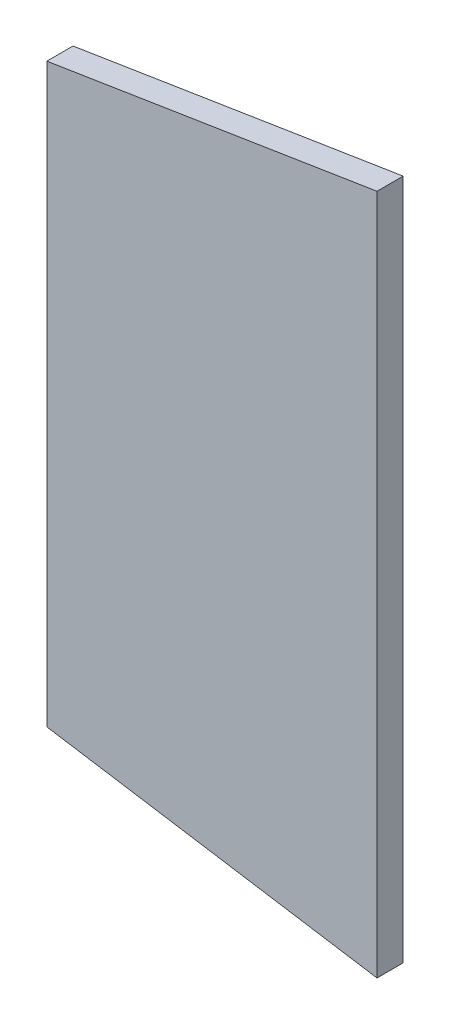
ISO-10303-21;
HEADER;
FILE_DESCRIPTION(('STEP AP214'),'2;1');
FILE_NAME('part.step','',(''),(''),'','','');
FILE_SCHEMA(('AUTOMOTIVE_DESIGN { 1 0 10303 214 1 1 1 1 }'));
ENDSEC;
DATA;
#1=APPLICATION_CONTEXT('core data for automotive mechanical design processes');
#2=APPLICATION_PROTOCOL_DEFINITION('international standard','automotive_design',2000,#1);
#3=PRODUCT_CONTEXT('',#1,'mechanical');
#4=PRODUCT('Part','Part','',(#3));
#5=PRODUCT_RELATED_PRODUCT_CATEGORY('part','',(#4));
#6=PRODUCT_DEFINITION_FORMATION('','',#4);
#7=PRODUCT_DEFINITION_CONTEXT('part definition',#1,'design');
#8=PRODUCT_DEFINITION('design','',#6,#7);
#9=PRODUCT_DEFINITION_SHAPE('','',#8);
#10=(LENGTH_UNIT() NAMED_UNIT(*) SI_UNIT(.MILLI.,.METRE.));
#11=(NAMED_UNIT(*) PLANE_ANGLE_UNIT() SI_UNIT($,.RADIAN.));
#12=(NAMED_UNIT(*) SI_UNIT($,.STERADIAN.) SOLID_ANGLE_UNIT());
#13=UNCERTAINTY_MEASURE_WITH_UNIT(LENGTH_MEASURE(1.E-05),#10,'distance_accuracy_value','');
#14=(GEOMETRIC_REPRESENTATION_CONTEXT(3) GLOBAL_UNCERTAINTY_ASSIGNED_CONTEXT((#13)) GLOBAL_UNIT_ASSIGNED_CONTEXT((#10,
#11,#12)) REPRESENTATION_CONTEXT('',''));
#15=CARTESIAN_POINT('',(0.,0.,0.));
#16=DIRECTION('',(0.,0.,1.));
#17=DIRECTION('',(1.,0.,0.));
#18=AXIS2_PLACEMENT_3D('',#15,#16,#17);
#19=CARTESIAN_POINT('',(-0.31500064,0.55000144,0.0499999));
#20=DIRECTION('',(0.,0.,1.));
#21=DIRECTION('',(1.,0.,0.));
#22=AXIS2_PLACEMENT_3D('',#19,#20,#21);
#23=PLANE('',#22);
#24=DIRECTION('',(0.,1.,0.));
#25=VECTOR('',#24,1.);
#26=CARTESIAN_POINT('',(0.31500064,0.65000124,0.0499999));
#27=LINE('',#26,#25);
#28=CARTESIAN_POINT('',(0.315000640000003,0.650001239999983,0.0499999));
#29=VERTEX_POINT('',#28);
#30=CARTESIAN_POINT('',(0.31500064,-0.6499987,0.0499999));
#31=VERTEX_POINT('',#30);
#32=EDGE_CURVE('E52',#29,#31,#27,.F.);
#33=ORIENTED_EDGE('',*,*,#32,.F.);
#34=DIRECTION('',(-0.987635626323415,-0.156766927688066,0.));
#35=VECTOR('',#34,1.);
#36=CARTESIAN_POINT('',(-0.31500064,0.55000144,0.0499999));
#37=LINE('',#36,#35);
#38=CARTESIAN_POINT('',(-0.31500064,0.55000144,0.0499999));
#39=VERTEX_POINT('',#38);
#40=EDGE_CURVE('E67',#39,#29,#37,.F.);
#41=ORIENTED_EDGE('',*,*,#40,.F.);
#42=DIRECTION('',(0.,1.,0.));
#43=VECTOR('',#42,1.);
#44=CARTESIAN_POINT('',(-0.31500064,-0.5499989,0.0499999));
#45=LINE('',#44,#43);
#46=CARTESIAN_POINT('',(-0.315000640000003,-0.549998900000017,0.0499999));
#47=VERTEX_POINT('',#46);
#48=EDGE_CURVE('E19',#47,#39,#45,.T.);
#49=ORIENTED_EDGE('',*,*,#48,.F.);
#50=DIRECTION('',(0.987635626323415,-0.156766927688066,0.));
#51=VECTOR('',#50,1.);
#52=CARTESIAN_POINT('',(0.31500064,-0.6499987,0.0499999));
#53=LINE('',#52,#51);
#54=EDGE_CURVE('E57',#31,#47,#53,.F.);
#55=ORIENTED_EDGE('',*,*,#54,.F.);
#56=EDGE_LOOP('',(#33,#41,#49,#55));
#57=FACE_BOUND('',#56,.T.);
#58=ADVANCED_FACE('F16',(#57),#23,.T.);
#59=CARTESIAN_POINT('',(-0.31500064,-0.5499989,0.));
#60=DIRECTION('',(-1.,0.,0.));
#61=DIRECTION('',(0.,0.,1.));
#62=AXIS2_PLACEMENT_3D('',#59,#60,#61);
#63=PLANE('',#62);
#64=DIRECTION('',(0.,0.,1.));
#65=VECTOR('',#64,1.);
#66=CARTESIAN_POINT('',(-0.31500064,0.55000144,0.));
#67=LINE('',#66,#65);
#68=CARTESIAN_POINT('',(-0.31500064,0.55000144,0.));
#69=VERTEX_POINT('',#68);
#70=EDGE_CURVE('E78',#69,#39,#67,.T.);
#71=ORIENTED_EDGE('',*,*,#70,.F.);
#72=DIRECTION('',(0.,1.,0.));
#73=VECTOR('',#72,1.);
#74=CARTESIAN_POINT('',(-0.31500064,0.55000144,0.));
#75=LINE('',#74,#73);
#76=CARTESIAN_POINT('',(-0.315000640000003,-0.549998900000017,0.));
#77=VERTEX_POINT('',#76);
#78=EDGE_CURVE('E73',#69,#77,#75,.F.);
#79=ORIENTED_EDGE('',*,*,#78,.T.);
#80=DIRECTION('',(0.,0.,1.));
#81=VECTOR('',#80,1.);
#82=CARTESIAN_POINT('',(-0.315000640000011,-0.549998900000067,0.));
#83=LINE('',#82,#81);
#84=EDGE_CURVE('E62',#47,#77,#83,.F.);
#85=ORIENTED_EDGE('',*,*,#84,.F.);
#86=ORIENTED_EDGE('',*,*,#48,.T.);
#87=EDGE_LOOP('',(#71,#79,#85,#86));
#88=FACE_BOUND('',#87,.T.);
#89=ADVANCED_FACE('F72',(#88),#63,.T.);
#90=CARTESIAN_POINT('',(0.31500064,-0.6499987,0.));
#91=DIRECTION('',(-0.156766927688066,-0.987635626323415,0.));
#92=DIRECTION('',(0.987635626323415,-0.156766927688066,0.));
#93=AXIS2_PLACEMENT_3D('',#90,#91,#92);
#94=PLANE('',#93);
#95=ORIENTED_EDGE('',*,*,#84,.T.);
#96=DIRECTION('',(0.987635626323399,-0.15676692768817,0.));
#97=VECTOR('',#96,1.);
#98=CARTESIAN_POINT('',(-0.31500064,-0.5499989,0.));
#99=LINE('',#98,#97);
#100=CARTESIAN_POINT('',(0.31500064,-0.6499987,0.));
#101=VERTEX_POINT('',#100);
#102=EDGE_CURVE('E83',#77,#101,#99,.T.);
#103=ORIENTED_EDGE('',*,*,#102,.T.);
#104=DIRECTION('',(0.,0.,-1.));
#105=VECTOR('',#104,1.);
#106=CARTESIAN_POINT('',(0.31500064,-0.6499987,0.));
#107=LINE('',#106,#105);
#108=EDGE_CURVE('E64',#31,#101,#107,.T.);
#109=ORIENTED_EDGE('',*,*,#108,.F.);
#110=ORIENTED_EDGE('',*,*,#54,.T.);
#111=EDGE_LOOP('',(#95,#103,#109,#110));
#112=FACE_BOUND('',#111,.T.);
#113=ADVANCED_FACE('F59',(#112),#94,.T.);
#114=CARTESIAN_POINT('',(0.31500064,0.65000124,0.));
#115=DIRECTION('',(1.,0.,0.));
#116=DIRECTION('',(0.,0.,-1.));
#117=AXIS2_PLACEMENT_3D('',#114,#115,#116);
#118=PLANE('',#117);
#119=ORIENTED_EDGE('',*,*,#108,.T.);
#120=DIRECTION('',(0.,1.,0.));
#121=VECTOR('',#120,1.);
#122=CARTESIAN_POINT('',(0.31500064,0.55000144,0.));
#123=LINE('',#122,#121);
#124=CARTESIAN_POINT('',(0.315000640000003,0.650001239999983,0.));
#125=VERTEX_POINT('',#124);
#126=EDGE_CURVE('E25',#101,#125,#123,.T.);
#127=ORIENTED_EDGE('',*,*,#126,.T.);
#128=DIRECTION('',(0.,0.,1.));
#129=VECTOR('',#128,1.);
#130=CARTESIAN_POINT('',(0.315000640000011,0.650001239999933,0.));
#131=LINE('',#130,#129);
#132=EDGE_CURVE('E33',#29,#125,#131,.F.);
#133=ORIENTED_EDGE('',*,*,#132,.F.);
#134=ORIENTED_EDGE('',*,*,#32,.T.);
#135=EDGE_LOOP('',(#119,#127,#133,#134));
#136=FACE_BOUND('',#135,.T.);
#137=ADVANCED_FACE('F87',(#136),#118,.T.);
#138=CARTESIAN_POINT('',(-0.31500064,0.55000144,0.));
#139=DIRECTION('',(-0.156766927688066,0.987635626323415,0.));
#140=DIRECTION('',(-0.987635626323415,-0.156766927688066,0.));
#141=AXIS2_PLACEMENT_3D('',#138,#139,#140);
#142=PLANE('',#141);
#143=ORIENTED_EDGE('',*,*,#132,.T.);
#144=DIRECTION('',(-0.987635626323399,-0.15676692768817,0.));
#145=VECTOR('',#144,1.);
#146=CARTESIAN_POINT('',(0.31500064,0.65000124,0.));
#147=LINE('',#146,#145);
#148=EDGE_CURVE('E11',#125,#69,#147,.T.);
#149=ORIENTED_EDGE('',*,*,#148,.T.);
#150=ORIENTED_EDGE('',*,*,#70,.T.);
#151=ORIENTED_EDGE('',*,*,#40,.T.);
#152=EDGE_LOOP('',(#143,#149,#150,#151));
#153=FACE_BOUND('',#152,.T.);
#154=ADVANCED_FACE('F90',(#153),#142,.T.);
#155=CARTESIAN_POINT('',(-0.31500064,0.55000144,0.));
#156=DIRECTION('',(0.,0.,1.));
#157=DIRECTION('',(1.,0.,0.));
#158=AXIS2_PLACEMENT_3D('',#155,#156,#157);
#159=PLANE('',#158);
#160=ORIENTED_EDGE('',*,*,#126,.F.);
#161=ORIENTED_EDGE('',*,*,#102,.F.);
#162=ORIENTED_EDGE('',*,*,#78,.F.);
#163=ORIENTED_EDGE('',*,*,#148,.F.);
#164=EDGE_LOOP('',(#160,#161,#162,#163));
#165=FACE_BOUND('',#164,.T.);
#166=ADVANCED_FACE('F89',(#165),#159,.F.);
#167=CLOSED_SHELL('',(#58,#89,#113,#137,#154,#166));
#168=MANIFOLD_SOLID_BREP('B1',#167);
#169=ADVANCED_BREP_SHAPE_REPRESENTATION('',(#18,#168),#14);
#170=SHAPE_DEFINITION_REPRESENTATION(#9,#169);
ENDSEC;
END-ISO-10303-21;
